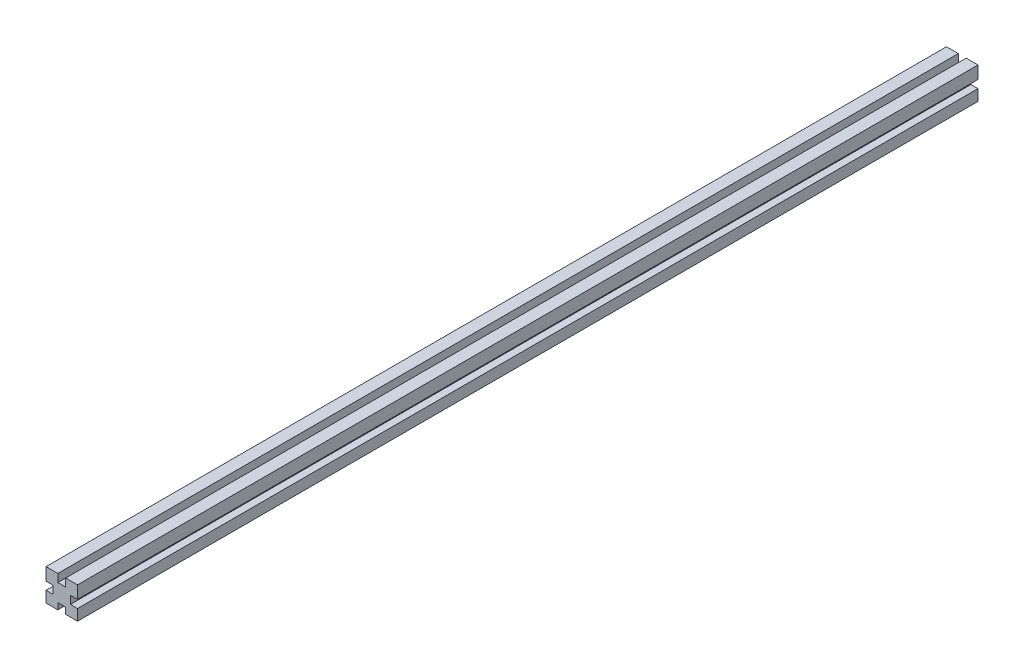
ISO-10303-21;
HEADER;
FILE_DESCRIPTION(('STEP AP214'),'2;1');
FILE_NAME('part.step','',(''),(''),'','','');
FILE_SCHEMA(('AUTOMOTIVE_DESIGN { 1 0 10303 214 1 1 1 1 }'));
ENDSEC;
DATA;
#1=APPLICATION_CONTEXT('core data for automotive mechanical design processes');
#2=APPLICATION_PROTOCOL_DEFINITION('international standard','automotive_design',2000,#1);
#3=PRODUCT_CONTEXT('',#1,'mechanical');
#4=PRODUCT('Part','Part','',(#3));
#5=PRODUCT_RELATED_PRODUCT_CATEGORY('part','',(#4));
#6=PRODUCT_DEFINITION_FORMATION('','',#4);
#7=PRODUCT_DEFINITION_CONTEXT('part definition',#1,'design');
#8=PRODUCT_DEFINITION('design','',#6,#7);
#9=PRODUCT_DEFINITION_SHAPE('','',#8);
#10=(LENGTH_UNIT() NAMED_UNIT(*) SI_UNIT(.MILLI.,.METRE.));
#11=(NAMED_UNIT(*) PLANE_ANGLE_UNIT() SI_UNIT($,.RADIAN.));
#12=(NAMED_UNIT(*) SI_UNIT($,.STERADIAN.) SOLID_ANGLE_UNIT());
#13=UNCERTAINTY_MEASURE_WITH_UNIT(LENGTH_MEASURE(1.E-05),#10,'distance_accuracy_value','');
#14=(GEOMETRIC_REPRESENTATION_CONTEXT(3) GLOBAL_UNCERTAINTY_ASSIGNED_CONTEXT((#13)) GLOBAL_UNIT_ASSIGNED_CONTEXT((#10,
#11,#12)) REPRESENTATION_CONTEXT('',''));
#15=CARTESIAN_POINT('',(0.,0.,0.));
#16=DIRECTION('',(0.,0.,1.));
#17=DIRECTION('',(1.,0.,0.));
#18=AXIS2_PLACEMENT_3D('',#15,#16,#17);
#19=CARTESIAN_POINT('',(10.,10.,-571.));
#20=DIRECTION('',(1.,0.,0.));
#21=DIRECTION('',(0.,0.,-1.));
#22=AXIS2_PLACEMENT_3D('',#19,#20,#21);
#23=PLANE('',#22);
#24=DIRECTION('',(0.,0.,-1.));
#25=VECTOR('',#24,1.);
#26=CARTESIAN_POINT('',(10.,-2.9999999999999,-571.));
#27=LINE('',#26,#25);
#28=CARTESIAN_POINT('',(10.,-2.9999999999999,0.));
#29=VERTEX_POINT('',#28);
#30=CARTESIAN_POINT('',(10.,-2.9999999999999,-571.));
#31=VERTEX_POINT('',#30);
#32=EDGE_CURVE('E239',#29,#31,#27,.T.);
#33=ORIENTED_EDGE('',*,*,#32,.F.);
#34=DIRECTION('',(0.,1.,0.));
#35=VECTOR('',#34,1.);
#36=CARTESIAN_POINT('',(10.,10.,0.));
#37=LINE('',#36,#35);
#38=CARTESIAN_POINT('',(10.,-10.,0.));
#39=VERTEX_POINT('',#38);
#40=EDGE_CURVE('E288',#39,#29,#37,.T.);
#41=ORIENTED_EDGE('',*,*,#40,.F.);
#42=DIRECTION('',(0.,0.,1.));
#43=VECTOR('',#42,1.);
#44=CARTESIAN_POINT('',(10.,-10.,-571.));
#45=LINE('',#44,#43);
#46=CARTESIAN_POINT('',(10.,-10.,-571.));
#47=VERTEX_POINT('',#46);
#48=EDGE_CURVE('E303',#47,#39,#45,.T.);
#49=ORIENTED_EDGE('',*,*,#48,.F.);
#50=DIRECTION('',(0.,1.,0.));
#51=VECTOR('',#50,1.);
#52=CARTESIAN_POINT('',(10.,10.,-571.));
#53=LINE('',#52,#51);
#54=EDGE_CURVE('E272',#47,#31,#53,.T.);
#55=ORIENTED_EDGE('',*,*,#54,.T.);
#56=EDGE_LOOP('',(#33,#41,#49,#55));
#57=FACE_BOUND('',#56,.T.);
#58=ADVANCED_FACE('F33',(#57),#23,.T.);
#59=CARTESIAN_POINT('',(-10.,-10.,-571.));
#60=DIRECTION('',(0.,-1.,0.));
#61=DIRECTION('',(0.,0.,-1.));
#62=AXIS2_PLACEMENT_3D('',#59,#60,#61);
#63=PLANE('',#62);
#64=DIRECTION('',(0.,0.,-1.));
#65=VECTOR('',#64,1.);
#66=CARTESIAN_POINT('',(-2.5,-10.,-571.));
#67=LINE('',#66,#65);
#68=CARTESIAN_POINT('',(-2.5,-10.,0.));
#69=VERTEX_POINT('',#68);
#70=CARTESIAN_POINT('',(-2.5,-10.,-571.));
#71=VERTEX_POINT('',#70);
#72=EDGE_CURVE('E242',#69,#71,#67,.T.);
#73=ORIENTED_EDGE('',*,*,#72,.F.);
#74=DIRECTION('',(1.,0.,0.));
#75=VECTOR('',#74,1.);
#76=CARTESIAN_POINT('',(-10.,-10.,0.));
#77=LINE('',#76,#75);
#78=CARTESIAN_POINT('',(-10.,-10.,0.));
#79=VERTEX_POINT('',#78);
#80=EDGE_CURVE('E300',#79,#69,#77,.T.);
#81=ORIENTED_EDGE('',*,*,#80,.F.);
#82=DIRECTION('',(0.,0.,1.));
#83=VECTOR('',#82,1.);
#84=CARTESIAN_POINT('',(-10.,-10.,-571.));
#85=LINE('',#84,#83);
#86=CARTESIAN_POINT('',(-10.,-10.,-571.));
#87=VERTEX_POINT('',#86);
#88=EDGE_CURVE('E307',#87,#79,#85,.T.);
#89=ORIENTED_EDGE('',*,*,#88,.F.);
#90=DIRECTION('',(1.,0.,0.));
#91=VECTOR('',#90,1.);
#92=CARTESIAN_POINT('',(-10.,-10.,-571.));
#93=LINE('',#92,#91);
#94=EDGE_CURVE('E284',#87,#71,#93,.T.);
#95=ORIENTED_EDGE('',*,*,#94,.T.);
#96=EDGE_LOOP('',(#73,#81,#89,#95));
#97=FACE_BOUND('',#96,.T.);
#98=ADVANCED_FACE('F333',(#97),#63,.T.);
#99=CARTESIAN_POINT('',(-10.,10.,-571.));
#100=DIRECTION('',(-1.,0.,0.));
#101=DIRECTION('',(0.,-1.,0.));
#102=AXIS2_PLACEMENT_3D('',#99,#100,#101);
#103=PLANE('',#102);
#104=DIRECTION('',(0.,0.,-1.));
#105=VECTOR('',#104,1.);
#106=CARTESIAN_POINT('',(-10.,1.99999999999996,-571.));
#107=LINE('',#106,#105);
#108=CARTESIAN_POINT('',(-10.,1.99999999999996,0.));
#109=VERTEX_POINT('',#108);
#110=CARTESIAN_POINT('',(-10.,1.99999999999996,-571.));
#111=VERTEX_POINT('',#110);
#112=EDGE_CURVE('E246',#109,#111,#107,.T.);
#113=ORIENTED_EDGE('',*,*,#112,.F.);
#114=DIRECTION('',(0.,-1.,0.));
#115=VECTOR('',#114,1.);
#116=CARTESIAN_POINT('',(-10.,10.,0.));
#117=LINE('',#116,#115);
#118=CARTESIAN_POINT('',(-10.,10.,0.));
#119=VERTEX_POINT('',#118);
#120=EDGE_CURVE('E296',#119,#109,#117,.T.);
#121=ORIENTED_EDGE('',*,*,#120,.F.);
#122=DIRECTION('',(0.,0.,1.));
#123=VECTOR('',#122,1.);
#124=CARTESIAN_POINT('',(-10.,10.,-571.));
#125=LINE('',#124,#123);
#126=CARTESIAN_POINT('',(-10.,10.,-571.));
#127=VERTEX_POINT('',#126);
#128=EDGE_CURVE('E310',#127,#119,#125,.T.);
#129=ORIENTED_EDGE('',*,*,#128,.F.);
#130=DIRECTION('',(0.,-1.,0.));
#131=VECTOR('',#130,1.);
#132=CARTESIAN_POINT('',(-10.,10.,-571.));
#133=LINE('',#132,#131);
#134=EDGE_CURVE('E280',#127,#111,#133,.T.);
#135=ORIENTED_EDGE('',*,*,#134,.T.);
#136=EDGE_LOOP('',(#113,#121,#129,#135));
#137=FACE_BOUND('',#136,.T.);
#138=ADVANCED_FACE('F381',(#137),#103,.T.);
#139=CARTESIAN_POINT('',(-10.,10.,-571.));
#140=DIRECTION('',(0.,1.,0.));
#141=DIRECTION('',(0.,0.,1.));
#142=AXIS2_PLACEMENT_3D('',#139,#140,#141);
#143=PLANE('',#142);
#144=DIRECTION('',(0.,0.,-1.));
#145=VECTOR('',#144,1.);
#146=CARTESIAN_POINT('',(2.5,10.,-571.));
#147=LINE('',#146,#145);
#148=CARTESIAN_POINT('',(2.5,10.,0.));
#149=VERTEX_POINT('',#148);
#150=CARTESIAN_POINT('',(2.5,10.,-571.));
#151=VERTEX_POINT('',#150);
#152=EDGE_CURVE('E269',#149,#151,#147,.T.);
#153=ORIENTED_EDGE('',*,*,#152,.F.);
#154=DIRECTION('',(-1.,0.,0.));
#155=VECTOR('',#154,1.);
#156=CARTESIAN_POINT('',(-10.,10.,0.));
#157=LINE('',#156,#155);
#158=CARTESIAN_POINT('',(10.,10.,0.));
#159=VERTEX_POINT('',#158);
#160=EDGE_CURVE('E292',#159,#149,#157,.T.);
#161=ORIENTED_EDGE('',*,*,#160,.F.);
#162=DIRECTION('',(0.,0.,1.));
#163=VECTOR('',#162,1.);
#164=CARTESIAN_POINT('',(10.,10.,-571.));
#165=LINE('',#164,#163);
#166=CARTESIAN_POINT('',(10.,10.,-571.));
#167=VERTEX_POINT('',#166);
#168=EDGE_CURVE('E287',#167,#159,#165,.T.);
#169=ORIENTED_EDGE('',*,*,#168,.F.);
#170=DIRECTION('',(-1.,0.,0.));
#171=VECTOR('',#170,1.);
#172=CARTESIAN_POINT('',(-10.,10.,-571.));
#173=LINE('',#172,#171);
#174=EDGE_CURVE('E277',#167,#151,#173,.T.);
#175=ORIENTED_EDGE('',*,*,#174,.T.);
#176=EDGE_LOOP('',(#153,#161,#169,#175));
#177=FACE_BOUND('',#176,.T.);
#178=ADVANCED_FACE('F359',(#177),#143,.T.);
#179=DIRECTION('',(0.,0.,1.));
#180=VECTOR('',#179,1.);
#181=CARTESIAN_POINT('',(10.,2.0000000000001,-571.));
#182=LINE('',#181,#180);
#183=CARTESIAN_POINT('',(10.,2.0000000000001,-571.));
#184=VERTEX_POINT('',#183);
#185=CARTESIAN_POINT('',(10.,2.00000000000008,0.));
#186=VERTEX_POINT('',#185);
#187=EDGE_CURVE('E48',#184,#186,#182,.T.);
#188=ORIENTED_EDGE('',*,*,#187,.F.);
#189=EDGE_CURVE('E276',#184,#167,#53,.T.);
#190=ORIENTED_EDGE('',*,*,#189,.T.);
#191=ORIENTED_EDGE('',*,*,#168,.T.);
#192=EDGE_CURVE('E271',#186,#159,#37,.T.);
#193=ORIENTED_EDGE('',*,*,#192,.F.);
#194=EDGE_LOOP('',(#188,#190,#191,#193));
#195=FACE_BOUND('',#194,.T.);
#196=ADVANCED_FACE('F35',(#195),#23,.T.);
#197=DIRECTION('',(0.,0.,1.));
#198=VECTOR('',#197,1.);
#199=CARTESIAN_POINT('',(2.5,-10.,-571.));
#200=LINE('',#199,#198);
#201=CARTESIAN_POINT('',(2.5,-10.,-571.));
#202=VERTEX_POINT('',#201);
#203=CARTESIAN_POINT('',(2.5,-10.,0.));
#204=VERTEX_POINT('',#203);
#205=EDGE_CURVE('E56',#202,#204,#200,.T.);
#206=ORIENTED_EDGE('',*,*,#205,.F.);
#207=EDGE_CURVE('E283',#202,#47,#93,.T.);
#208=ORIENTED_EDGE('',*,*,#207,.T.);
#209=ORIENTED_EDGE('',*,*,#48,.T.);
#210=EDGE_CURVE('E299',#204,#39,#77,.T.);
#211=ORIENTED_EDGE('',*,*,#210,.F.);
#212=EDGE_LOOP('',(#206,#208,#209,#211));
#213=FACE_BOUND('',#212,.T.);
#214=ADVANCED_FACE('F338',(#213),#63,.T.);
#215=DIRECTION('',(0.,0.,1.));
#216=VECTOR('',#215,1.);
#217=CARTESIAN_POINT('',(-10.,-3.00000000000004,-571.));
#218=LINE('',#217,#216);
#219=CARTESIAN_POINT('',(-10.,-3.00000000000004,-571.));
#220=VERTEX_POINT('',#219);
#221=CARTESIAN_POINT('',(-10.,-3.00000000000003,0.));
#222=VERTEX_POINT('',#221);
#223=EDGE_CURVE('E244',#220,#222,#218,.T.);
#224=ORIENTED_EDGE('',*,*,#223,.F.);
#225=EDGE_CURVE('E190',#220,#87,#133,.T.);
#226=ORIENTED_EDGE('',*,*,#225,.T.);
#227=ORIENTED_EDGE('',*,*,#88,.T.);
#228=EDGE_CURVE('E295',#222,#79,#117,.T.);
#229=ORIENTED_EDGE('',*,*,#228,.F.);
#230=EDGE_LOOP('',(#224,#226,#227,#229));
#231=FACE_BOUND('',#230,.T.);
#232=ADVANCED_FACE('F404',(#231),#103,.T.);
#233=DIRECTION('',(0.,0.,1.));
#234=VECTOR('',#233,1.);
#235=CARTESIAN_POINT('',(-2.5,10.,-571.));
#236=LINE('',#235,#234);
#237=CARTESIAN_POINT('',(-2.5,10.,-571.));
#238=VERTEX_POINT('',#237);
#239=CARTESIAN_POINT('',(-2.5,10.,0.));
#240=VERTEX_POINT('',#239);
#241=EDGE_CURVE('E265',#238,#240,#236,.T.);
#242=ORIENTED_EDGE('',*,*,#241,.F.);
#243=EDGE_CURVE('E275',#238,#127,#173,.T.);
#244=ORIENTED_EDGE('',*,*,#243,.T.);
#245=ORIENTED_EDGE('',*,*,#128,.T.);
#246=EDGE_CURVE('E291',#240,#119,#157,.T.);
#247=ORIENTED_EDGE('',*,*,#246,.F.);
#248=EDGE_LOOP('',(#242,#244,#245,#247));
#249=FACE_BOUND('',#248,.T.);
#250=ADVANCED_FACE('F374',(#249),#143,.T.);
#251=CARTESIAN_POINT('',(0.,0.,-571.));
#252=DIRECTION('',(0.,0.,1.));
#253=DIRECTION('',(1.,0.,0.));
#254=AXIS2_PLACEMENT_3D('',#251,#252,#253);
#255=PLANE('',#254);
#256=DIRECTION('',(0.,1.,0.));
#257=VECTOR('',#256,1.);
#258=CARTESIAN_POINT('',(-5.49999999999999,-3.00000000000002,-571.));
#259=LINE('',#258,#257);
#260=CARTESIAN_POINT('',(-5.49999999999999,-3.00000000000002,-571.));
#261=VERTEX_POINT('',#260);
#262=CARTESIAN_POINT('',(-5.50000000000001,1.99999999999998,-571.));
#263=VERTEX_POINT('',#262);
#264=EDGE_CURVE('E179',#261,#263,#259,.T.);
#265=ORIENTED_EDGE('',*,*,#264,.T.);
#266=DIRECTION('',(-1.,0.,0.));
#267=VECTOR('',#266,1.);
#268=CARTESIAN_POINT('',(-15.5,1.99999999999994,-571.));
#269=LINE('',#268,#267);
#270=EDGE_CURVE('E191',#263,#111,#269,.T.);
#271=ORIENTED_EDGE('',*,*,#270,.T.);
#272=ORIENTED_EDGE('',*,*,#134,.F.);
#273=ORIENTED_EDGE('',*,*,#243,.F.);
#274=DIRECTION('',(0.,-1.,0.));
#275=VECTOR('',#274,1.);
#276=CARTESIAN_POINT('',(-2.5,15.,-571.));
#277=LINE('',#276,#275);
#278=CARTESIAN_POINT('',(-2.5,5.,-571.));
#279=VERTEX_POINT('',#278);
#280=EDGE_CURVE('E252',#238,#279,#277,.T.);
#281=ORIENTED_EDGE('',*,*,#280,.T.);
#282=DIRECTION('',(1.,0.,0.));
#283=VECTOR('',#282,1.);
#284=CARTESIAN_POINT('',(-2.5,5.,-571.));
#285=LINE('',#284,#283);
#286=CARTESIAN_POINT('',(2.5,5.,-571.));
#287=VERTEX_POINT('',#286);
#288=EDGE_CURVE('E256',#279,#287,#285,.T.);
#289=ORIENTED_EDGE('',*,*,#288,.T.);
#290=DIRECTION('',(0.,1.,0.));
#291=VECTOR('',#290,1.);
#292=CARTESIAN_POINT('',(2.5,15.,-571.));
#293=LINE('',#292,#291);
#294=EDGE_CURVE('E249',#287,#151,#293,.T.);
#295=ORIENTED_EDGE('',*,*,#294,.T.);
#296=ORIENTED_EDGE('',*,*,#174,.F.);
#297=ORIENTED_EDGE('',*,*,#189,.F.);
#298=DIRECTION('',(-1.,0.,0.));
#299=VECTOR('',#298,1.);
#300=CARTESIAN_POINT('',(15.5,2.00000000000016,-571.));
#301=LINE('',#300,#299);
#302=CARTESIAN_POINT('',(5.49999999999997,2.00000000000006,-571.));
#303=VERTEX_POINT('',#302);
#304=EDGE_CURVE('E223',#184,#303,#301,.T.);
#305=ORIENTED_EDGE('',*,*,#304,.T.);
#306=DIRECTION('',(0.,-1.,0.));
#307=VECTOR('',#306,1.);
#308=CARTESIAN_POINT('',(5.49999999999997,2.00000000000006,-571.));
#309=LINE('',#308,#307);
#310=CARTESIAN_POINT('',(5.50000000000003,-2.99999999999994,-571.));
#311=VERTEX_POINT('',#310);
#312=EDGE_CURVE('E227',#303,#311,#309,.T.);
#313=ORIENTED_EDGE('',*,*,#312,.T.);
#314=DIRECTION('',(1.,0.,0.));
#315=VECTOR('',#314,1.);
#316=CARTESIAN_POINT('',(15.5,-2.99999999999984,-571.));
#317=LINE('',#316,#315);
#318=EDGE_CURVE('E220',#311,#31,#317,.T.);
#319=ORIENTED_EDGE('',*,*,#318,.T.);
#320=ORIENTED_EDGE('',*,*,#54,.F.);
#321=ORIENTED_EDGE('',*,*,#207,.F.);
#322=DIRECTION('',(0.,1.,0.));
#323=VECTOR('',#322,1.);
#324=CARTESIAN_POINT('',(2.5,-16.,-571.));
#325=LINE('',#324,#323);
#326=CARTESIAN_POINT('',(2.5,-6.,-571.));
#327=VERTEX_POINT('',#326);
#328=EDGE_CURVE('E204',#202,#327,#325,.T.);
#329=ORIENTED_EDGE('',*,*,#328,.T.);
#330=DIRECTION('',(-1.,0.,0.));
#331=VECTOR('',#330,1.);
#332=CARTESIAN_POINT('',(2.5,-6.,-571.));
#333=LINE('',#332,#331);
#334=CARTESIAN_POINT('',(-2.5,-6.,-571.));
#335=VERTEX_POINT('',#334);
#336=EDGE_CURVE('E208',#327,#335,#333,.T.);
#337=ORIENTED_EDGE('',*,*,#336,.T.);
#338=DIRECTION('',(0.,-1.,0.));
#339=VECTOR('',#338,1.);
#340=CARTESIAN_POINT('',(-2.5,-16.,-571.));
#341=LINE('',#340,#339);
#342=EDGE_CURVE('E201',#335,#71,#341,.T.);
#343=ORIENTED_EDGE('',*,*,#342,.T.);
#344=ORIENTED_EDGE('',*,*,#94,.F.);
#345=ORIENTED_EDGE('',*,*,#225,.F.);
#346=DIRECTION('',(1.,0.,0.));
#347=VECTOR('',#346,1.);
#348=CARTESIAN_POINT('',(-15.5,-3.00000000000006,-571.));
#349=LINE('',#348,#347);
#350=EDGE_CURVE('E172',#220,#261,#349,.T.);
#351=ORIENTED_EDGE('',*,*,#350,.T.);
#352=EDGE_LOOP('',(#265,#271,#272,#273,#281,#289,#295,#296,#297,#305,#313,#319,#320,#321,#329,
#337,#343,#344,#345,#351));
#353=FACE_BOUND('',#352,.T.);
#354=ADVANCED_FACE('F188',(#353),#255,.F.);
#355=CARTESIAN_POINT('',(0.,0.,0.));
#356=DIRECTION('',(0.,0.,1.));
#357=DIRECTION('',(1.,0.,0.));
#358=AXIS2_PLACEMENT_3D('',#355,#356,#357);
#359=PLANE('',#358);
#360=DIRECTION('',(-1.,0.,0.));
#361=VECTOR('',#360,1.);
#362=CARTESIAN_POINT('',(-15.5,1.99999999999994,0.));
#363=LINE('',#362,#361);
#364=CARTESIAN_POINT('',(-5.50000000000001,1.99999999999998,0.));
#365=VERTEX_POINT('',#364);
#366=EDGE_CURVE('E196',#365,#109,#363,.T.);
#367=ORIENTED_EDGE('',*,*,#366,.F.);
#368=DIRECTION('',(0.,1.,0.));
#369=VECTOR('',#368,1.);
#370=CARTESIAN_POINT('',(-5.49999999999999,-3.00000000000002,0.));
#371=LINE('',#370,#369);
#372=CARTESIAN_POINT('',(-5.49999999999999,-3.00000000000002,0.));
#373=VERTEX_POINT('',#372);
#374=EDGE_CURVE('E193',#373,#365,#371,.T.);
#375=ORIENTED_EDGE('',*,*,#374,.F.);
#376=DIRECTION('',(1.,0.,0.));
#377=VECTOR('',#376,1.);
#378=CARTESIAN_POINT('',(0.,-3.,0.));
#379=LINE('',#378,#377);
#380=EDGE_CURVE('E11',#222,#373,#379,.T.);
#381=ORIENTED_EDGE('',*,*,#380,.F.);
#382=ORIENTED_EDGE('',*,*,#228,.T.);
#383=ORIENTED_EDGE('',*,*,#80,.T.);
#384=DIRECTION('',(0.,-1.,0.));
#385=VECTOR('',#384,1.);
#386=CARTESIAN_POINT('',(-2.5,-16.,0.));
#387=LINE('',#386,#385);
#388=CARTESIAN_POINT('',(-2.5,-6.,0.));
#389=VERTEX_POINT('',#388);
#390=EDGE_CURVE('E212',#389,#69,#387,.T.);
#391=ORIENTED_EDGE('',*,*,#390,.F.);
#392=DIRECTION('',(-1.,0.,0.));
#393=VECTOR('',#392,1.);
#394=CARTESIAN_POINT('',(2.5,-6.,0.));
#395=LINE('',#394,#393);
#396=CARTESIAN_POINT('',(2.5,-6.,0.));
#397=VERTEX_POINT('',#396);
#398=EDGE_CURVE('E205',#397,#389,#395,.T.);
#399=ORIENTED_EDGE('',*,*,#398,.F.);
#400=DIRECTION('',(0.,1.,0.));
#401=VECTOR('',#400,1.);
#402=CARTESIAN_POINT('',(2.5,0.,0.));
#403=LINE('',#402,#401);
#404=EDGE_CURVE('E41',#204,#397,#403,.T.);
#405=ORIENTED_EDGE('',*,*,#404,.F.);
#406=ORIENTED_EDGE('',*,*,#210,.T.);
#407=ORIENTED_EDGE('',*,*,#40,.T.);
#408=DIRECTION('',(1.,0.,0.));
#409=VECTOR('',#408,1.);
#410=CARTESIAN_POINT('',(15.5,-2.99999999999984,0.));
#411=LINE('',#410,#409);
#412=CARTESIAN_POINT('',(5.50000000000003,-2.99999999999994,0.));
#413=VERTEX_POINT('',#412);
#414=EDGE_CURVE('E231',#413,#29,#411,.T.);
#415=ORIENTED_EDGE('',*,*,#414,.F.);
#416=DIRECTION('',(0.,-1.,0.));
#417=VECTOR('',#416,1.);
#418=CARTESIAN_POINT('',(5.49999999999997,2.00000000000006,0.));
#419=LINE('',#418,#417);
#420=CARTESIAN_POINT('',(5.49999999999997,2.00000000000006,0.));
#421=VERTEX_POINT('',#420);
#422=EDGE_CURVE('E224',#421,#413,#419,.T.);
#423=ORIENTED_EDGE('',*,*,#422,.F.);
#424=DIRECTION('',(-1.,0.,0.));
#425=VECTOR('',#424,1.);
#426=CARTESIAN_POINT('',(0.,2.,0.));
#427=LINE('',#426,#425);
#428=EDGE_CURVE('E316',#186,#421,#427,.T.);
#429=ORIENTED_EDGE('',*,*,#428,.F.);
#430=ORIENTED_EDGE('',*,*,#192,.T.);
#431=ORIENTED_EDGE('',*,*,#160,.T.);
#432=DIRECTION('',(0.,1.,0.));
#433=VECTOR('',#432,1.);
#434=CARTESIAN_POINT('',(2.5,15.,0.));
#435=LINE('',#434,#433);
#436=CARTESIAN_POINT('',(2.5,5.,0.));
#437=VERTEX_POINT('',#436);
#438=EDGE_CURVE('E248',#437,#149,#435,.T.);
#439=ORIENTED_EDGE('',*,*,#438,.F.);
#440=DIRECTION('',(1.,0.,0.));
#441=VECTOR('',#440,1.);
#442=CARTESIAN_POINT('',(-2.5,5.,0.));
#443=LINE('',#442,#441);
#444=CARTESIAN_POINT('',(-2.5,5.,0.));
#445=VERTEX_POINT('',#444);
#446=EDGE_CURVE('E253',#445,#437,#443,.T.);
#447=ORIENTED_EDGE('',*,*,#446,.F.);
#448=DIRECTION('',(0.,-1.,0.));
#449=VECTOR('',#448,1.);
#450=CARTESIAN_POINT('',(-2.5,0.,0.));
#451=LINE('',#450,#449);
#452=EDGE_CURVE('E306',#240,#445,#451,.T.);
#453=ORIENTED_EDGE('',*,*,#452,.F.);
#454=ORIENTED_EDGE('',*,*,#246,.T.);
#455=ORIENTED_EDGE('',*,*,#120,.T.);
#456=EDGE_LOOP('',(#367,#375,#381,#382,#383,#391,#399,#405,#406,#407,#415,#423,#429,#430,#431,
#439,#447,#453,#454,#455));
#457=FACE_BOUND('',#456,.T.);
#458=ADVANCED_FACE('F326',(#457),#359,.T.);
#459=CARTESIAN_POINT('',(2.5,15.,-571.));
#460=DIRECTION('',(1.,0.,0.));
#461=DIRECTION('',(0.,1.,0.));
#462=AXIS2_PLACEMENT_3D('',#459,#460,#461);
#463=PLANE('',#462);
#464=ORIENTED_EDGE('',*,*,#152,.T.);
#465=ORIENTED_EDGE('',*,*,#294,.F.);
#466=DIRECTION('',(0.,0.,1.));
#467=VECTOR('',#466,1.);
#468=CARTESIAN_POINT('',(2.5,5.,-571.));
#469=LINE('',#468,#467);
#470=EDGE_CURVE('E263',#287,#437,#469,.T.);
#471=ORIENTED_EDGE('',*,*,#470,.T.);
#472=ORIENTED_EDGE('',*,*,#438,.T.);
#473=EDGE_LOOP('',(#464,#465,#471,#472));
#474=FACE_BOUND('',#473,.T.);
#475=ADVANCED_FACE('F364',(#474),#463,.F.);
#476=CARTESIAN_POINT('',(-2.5,5.,-571.));
#477=DIRECTION('',(0.,-1.,0.));
#478=DIRECTION('',(0.,0.,-1.));
#479=AXIS2_PLACEMENT_3D('',#476,#477,#478);
#480=PLANE('',#479);
#481=ORIENTED_EDGE('',*,*,#446,.T.);
#482=ORIENTED_EDGE('',*,*,#470,.F.);
#483=ORIENTED_EDGE('',*,*,#288,.F.);
#484=DIRECTION('',(0.,0.,1.));
#485=VECTOR('',#484,1.);
#486=CARTESIAN_POINT('',(-2.5,5.,-571.));
#487=LINE('',#486,#485);
#488=EDGE_CURVE('E259',#279,#445,#487,.T.);
#489=ORIENTED_EDGE('',*,*,#488,.T.);
#490=EDGE_LOOP('',(#481,#482,#483,#489));
#491=FACE_BOUND('',#490,.T.);
#492=ADVANCED_FACE('F368',(#491),#480,.F.);
#493=CARTESIAN_POINT('',(-2.5,15.,-571.));
#494=DIRECTION('',(-1.,0.,0.));
#495=DIRECTION('',(0.,-1.,0.));
#496=AXIS2_PLACEMENT_3D('',#493,#494,#495);
#497=PLANE('',#496);
#498=ORIENTED_EDGE('',*,*,#241,.T.);
#499=ORIENTED_EDGE('',*,*,#452,.T.);
#500=ORIENTED_EDGE('',*,*,#488,.F.);
#501=ORIENTED_EDGE('',*,*,#280,.F.);
#502=EDGE_LOOP('',(#498,#499,#500,#501));
#503=FACE_BOUND('',#502,.T.);
#504=ADVANCED_FACE('F370',(#503),#497,.F.);
#505=CARTESIAN_POINT('',(15.5,-2.99999999999984,-571.));
#506=DIRECTION('',(0.,-1.,0.));
#507=DIRECTION('',(1.,0.,0.));
#508=AXIS2_PLACEMENT_3D('',#505,#506,#507);
#509=PLANE('',#508);
#510=ORIENTED_EDGE('',*,*,#32,.T.);
#511=ORIENTED_EDGE('',*,*,#318,.F.);
#512=DIRECTION('',(0.,0.,1.));
#513=VECTOR('',#512,1.);
#514=CARTESIAN_POINT('',(5.50000000000003,-2.99999999999994,-571.));
#515=LINE('',#514,#513);
#516=EDGE_CURVE('E214',#311,#413,#515,.T.);
#517=ORIENTED_EDGE('',*,*,#516,.T.);
#518=ORIENTED_EDGE('',*,*,#414,.T.);
#519=EDGE_LOOP('',(#510,#511,#517,#518));
#520=FACE_BOUND('',#519,.T.);
#521=ADVANCED_FACE('F347',(#520),#509,.F.);
#522=CARTESIAN_POINT('',(5.49999999999997,2.00000000000006,-571.));
#523=DIRECTION('',(-1.,0.,0.));
#524=DIRECTION('',(0.,-1.,0.));
#525=AXIS2_PLACEMENT_3D('',#522,#523,#524);
#526=PLANE('',#525);
#527=ORIENTED_EDGE('',*,*,#422,.T.);
#528=ORIENTED_EDGE('',*,*,#516,.F.);
#529=ORIENTED_EDGE('',*,*,#312,.F.);
#530=DIRECTION('',(0.,0.,1.));
#531=VECTOR('',#530,1.);
#532=CARTESIAN_POINT('',(5.49999999999997,2.00000000000006,-571.));
#533=LINE('',#532,#531);
#534=EDGE_CURVE('E230',#303,#421,#533,.T.);
#535=ORIENTED_EDGE('',*,*,#534,.T.);
#536=EDGE_LOOP('',(#527,#528,#529,#535));
#537=FACE_BOUND('',#536,.T.);
#538=ADVANCED_FACE('F351',(#537),#526,.F.);
#539=CARTESIAN_POINT('',(15.5,2.00000000000016,-571.));
#540=DIRECTION('',(0.,1.,0.));
#541=DIRECTION('',(-1.,0.,0.));
#542=AXIS2_PLACEMENT_3D('',#539,#540,#541);
#543=PLANE('',#542);
#544=ORIENTED_EDGE('',*,*,#187,.T.);
#545=ORIENTED_EDGE('',*,*,#428,.T.);
#546=ORIENTED_EDGE('',*,*,#534,.F.);
#547=ORIENTED_EDGE('',*,*,#304,.F.);
#548=EDGE_LOOP('',(#544,#545,#546,#547));
#549=FACE_BOUND('',#548,.T.);
#550=ADVANCED_FACE('F429',(#549),#543,.F.);
#551=CARTESIAN_POINT('',(-2.5,-16.,-571.));
#552=DIRECTION('',(-1.,0.,0.));
#553=DIRECTION('',(0.,-1.,0.));
#554=AXIS2_PLACEMENT_3D('',#551,#552,#553);
#555=PLANE('',#554);
#556=ORIENTED_EDGE('',*,*,#72,.T.);
#557=ORIENTED_EDGE('',*,*,#342,.F.);
#558=DIRECTION('',(0.,0.,1.));
#559=VECTOR('',#558,1.);
#560=CARTESIAN_POINT('',(-2.5,-6.,-571.));
#561=LINE('',#560,#559);
#562=EDGE_CURVE('E198',#335,#389,#561,.T.);
#563=ORIENTED_EDGE('',*,*,#562,.T.);
#564=ORIENTED_EDGE('',*,*,#390,.T.);
#565=EDGE_LOOP('',(#556,#557,#563,#564));
#566=FACE_BOUND('',#565,.T.);
#567=ADVANCED_FACE('F330',(#566),#555,.F.);
#568=CARTESIAN_POINT('',(2.5,-6.,-571.));
#569=DIRECTION('',(0.,1.,0.));
#570=DIRECTION('',(0.,0.,1.));
#571=AXIS2_PLACEMENT_3D('',#568,#569,#570);
#572=PLANE('',#571);
#573=ORIENTED_EDGE('',*,*,#398,.T.);
#574=ORIENTED_EDGE('',*,*,#562,.F.);
#575=ORIENTED_EDGE('',*,*,#336,.F.);
#576=DIRECTION('',(0.,0.,1.));
#577=VECTOR('',#576,1.);
#578=CARTESIAN_POINT('',(2.5,-6.,-571.));
#579=LINE('',#578,#577);
#580=EDGE_CURVE('E211',#327,#397,#579,.T.);
#581=ORIENTED_EDGE('',*,*,#580,.T.);
#582=EDGE_LOOP('',(#573,#574,#575,#581));
#583=FACE_BOUND('',#582,.T.);
#584=ADVANCED_FACE('F323',(#583),#572,.F.);
#585=CARTESIAN_POINT('',(2.5,-16.,-571.));
#586=DIRECTION('',(1.,0.,0.));
#587=DIRECTION('',(0.,1.,0.));
#588=AXIS2_PLACEMENT_3D('',#585,#586,#587);
#589=PLANE('',#588);
#590=ORIENTED_EDGE('',*,*,#205,.T.);
#591=ORIENTED_EDGE('',*,*,#404,.T.);
#592=ORIENTED_EDGE('',*,*,#580,.F.);
#593=ORIENTED_EDGE('',*,*,#328,.F.);
#594=EDGE_LOOP('',(#590,#591,#592,#593));
#595=FACE_BOUND('',#594,.T.);
#596=ADVANCED_FACE('F317',(#595),#589,.F.);
#597=CARTESIAN_POINT('',(-15.5,1.99999999999994,-571.));
#598=DIRECTION('',(0.,1.,0.));
#599=DIRECTION('',(-1.,0.,0.));
#600=AXIS2_PLACEMENT_3D('',#597,#598,#599);
#601=PLANE('',#600);
#602=ORIENTED_EDGE('',*,*,#112,.T.);
#603=ORIENTED_EDGE('',*,*,#270,.F.);
#604=DIRECTION('',(0.,0.,1.));
#605=VECTOR('',#604,1.);
#606=CARTESIAN_POINT('',(-5.50000000000001,1.99999999999998,-571.));
#607=LINE('',#606,#605);
#608=EDGE_CURVE('E178',#263,#365,#607,.T.);
#609=ORIENTED_EDGE('',*,*,#608,.T.);
#610=ORIENTED_EDGE('',*,*,#366,.T.);
#611=EDGE_LOOP('',(#602,#603,#609,#610));
#612=FACE_BOUND('',#611,.T.);
#613=ADVANCED_FACE('F383',(#612),#601,.F.);
#614=CARTESIAN_POINT('',(-5.49999999999999,-3.00000000000002,-571.));
#615=DIRECTION('',(1.,0.,0.));
#616=DIRECTION('',(0.,1.,0.));
#617=AXIS2_PLACEMENT_3D('',#614,#615,#616);
#618=PLANE('',#617);
#619=ORIENTED_EDGE('',*,*,#374,.T.);
#620=ORIENTED_EDGE('',*,*,#608,.F.);
#621=ORIENTED_EDGE('',*,*,#264,.F.);
#622=DIRECTION('',(0.,0.,1.));
#623=VECTOR('',#622,1.);
#624=CARTESIAN_POINT('',(-5.49999999999999,-3.00000000000002,-571.));
#625=LINE('',#624,#623);
#626=EDGE_CURVE('E168',#261,#373,#625,.T.);
#627=ORIENTED_EDGE('',*,*,#626,.T.);
#628=EDGE_LOOP('',(#619,#620,#621,#627));
#629=FACE_BOUND('',#628,.T.);
#630=ADVANCED_FACE('F182',(#629),#618,.F.);
#631=CARTESIAN_POINT('',(-15.5,-3.00000000000006,-571.));
#632=DIRECTION('',(0.,-1.,0.));
#633=DIRECTION('',(1.,0.,0.));
#634=AXIS2_PLACEMENT_3D('',#631,#632,#633);
#635=PLANE('',#634);
#636=ORIENTED_EDGE('',*,*,#223,.T.);
#637=ORIENTED_EDGE('',*,*,#380,.T.);
#638=ORIENTED_EDGE('',*,*,#626,.F.);
#639=ORIENTED_EDGE('',*,*,#350,.F.);
#640=EDGE_LOOP('',(#636,#637,#638,#639));
#641=FACE_BOUND('',#640,.T.);
#642=ADVANCED_FACE('F170',(#641),#635,.F.);
#643=CLOSED_SHELL('',(#58,#98,#138,#178,#196,#214,#232,#250,#354,#458,#475,#492,#504,#521,#538,
#550,#567,#584,#596,#613,#630,#642));
#644=MANIFOLD_SOLID_BREP('B2',#643);
#645=ADVANCED_BREP_SHAPE_REPRESENTATION('',(#18,#644),#14);
#646=SHAPE_DEFINITION_REPRESENTATION(#9,#645);
ENDSEC;
END-ISO-10303-21;
